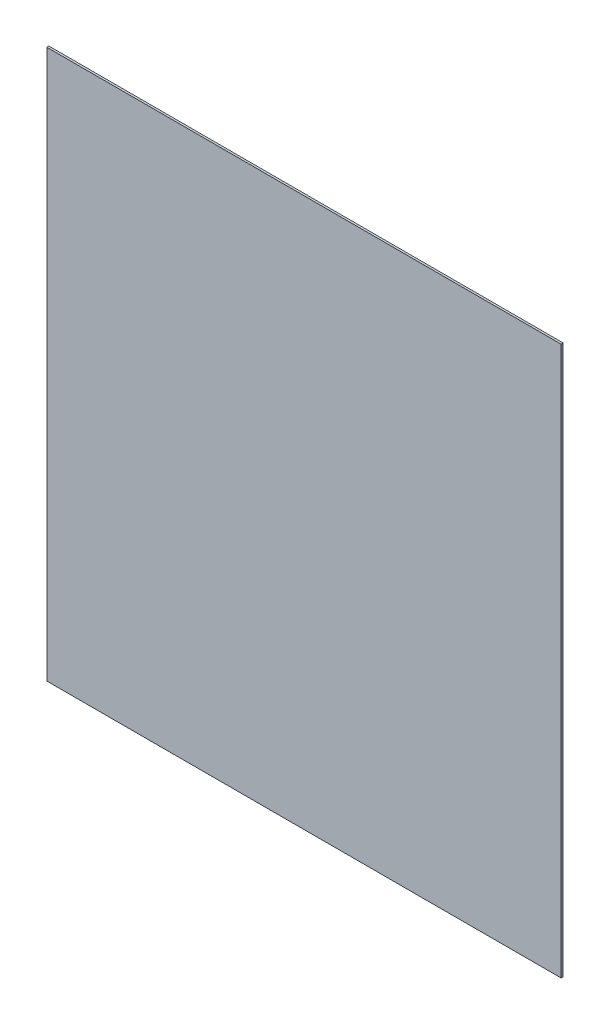
ISO-10303-21;
HEADER;
FILE_DESCRIPTION(('STEP AP214'),'2;1');
FILE_NAME('part.step','',(''),(''),'','','');
FILE_SCHEMA(('AUTOMOTIVE_DESIGN { 1 0 10303 214 1 1 1 1 }'));
ENDSEC;
DATA;
#1=APPLICATION_CONTEXT('core data for automotive mechanical design processes');
#2=APPLICATION_PROTOCOL_DEFINITION('international standard','automotive_design',2000,#1);
#3=PRODUCT_CONTEXT('',#1,'mechanical');
#4=PRODUCT('Part','Part','',(#3));
#5=PRODUCT_RELATED_PRODUCT_CATEGORY('part','',(#4));
#6=PRODUCT_DEFINITION_FORMATION('','',#4);
#7=PRODUCT_DEFINITION_CONTEXT('part definition',#1,'design');
#8=PRODUCT_DEFINITION('design','',#6,#7);
#9=PRODUCT_DEFINITION_SHAPE('','',#8);
#10=(LENGTH_UNIT() NAMED_UNIT(*) SI_UNIT(.MILLI.,.METRE.));
#11=(NAMED_UNIT(*) PLANE_ANGLE_UNIT() SI_UNIT($,.RADIAN.));
#12=(NAMED_UNIT(*) SI_UNIT($,.STERADIAN.) SOLID_ANGLE_UNIT());
#13=UNCERTAINTY_MEASURE_WITH_UNIT(LENGTH_MEASURE(1.E-05),#10,'distance_accuracy_value','');
#14=(GEOMETRIC_REPRESENTATION_CONTEXT(3) GLOBAL_UNCERTAINTY_ASSIGNED_CONTEXT((#13)) GLOBAL_UNIT_ASSIGNED_CONTEXT((#10,
#11,#12)) REPRESENTATION_CONTEXT('',''));
#15=CARTESIAN_POINT('',(0.,0.,0.));
#16=DIRECTION('',(0.,0.,1.));
#17=DIRECTION('',(1.,0.,0.));
#18=AXIS2_PLACEMENT_3D('',#15,#16,#17);
#19=CARTESIAN_POINT('',(241.80799865722,158.75,0.41148));
#20=DIRECTION('',(0.,0.,1.));
#21=DIRECTION('',(1.,0.,0.));
#22=AXIS2_PLACEMENT_3D('',#19,#20,#21);
#23=PLANE('',#22);
#24=DIRECTION('',(1.,0.,0.));
#25=VECTOR('',#24,1.);
#26=CARTESIAN_POINT('',(241.80799865722,49.784000396729,0.41148));
#27=LINE('',#26,#25);
#28=CARTESIAN_POINT('',(241.80799865722,49.784000396729,0.41148));
#29=VERTEX_POINT('',#28);
#30=CARTESIAN_POINT('',(139.69999694824,49.784000396729,0.41148));
#31=VERTEX_POINT('',#30);
#32=EDGE_CURVE('E52',#29,#31,#27,.F.);
#33=ORIENTED_EDGE('',*,*,#32,.F.);
#34=DIRECTION('',(0.,1.,0.));
#35=VECTOR('',#34,1.);
#36=CARTESIAN_POINT('',(241.80799865722,158.75,0.41148));
#37=LINE('',#36,#35);
#38=CARTESIAN_POINT('',(241.80799865722,158.75,0.41148));
#39=VERTEX_POINT('',#38);
#40=EDGE_CURVE('E67',#39,#29,#37,.F.);
#41=ORIENTED_EDGE('',*,*,#40,.F.);
#42=DIRECTION('',(1.,0.,0.));
#43=VECTOR('',#42,1.);
#44=CARTESIAN_POINT('',(139.69999694824,158.75,0.41148));
#45=LINE('',#44,#43);
#46=CARTESIAN_POINT('',(139.69999694824,158.75,0.41148));
#47=VERTEX_POINT('',#46);
#48=EDGE_CURVE('E19',#47,#39,#45,.T.);
#49=ORIENTED_EDGE('',*,*,#48,.F.);
#50=DIRECTION('',(0.,1.,0.));
#51=VECTOR('',#50,1.);
#52=CARTESIAN_POINT('',(139.69999694824,49.784000396729,0.41148));
#53=LINE('',#52,#51);
#54=EDGE_CURVE('E57',#31,#47,#53,.T.);
#55=ORIENTED_EDGE('',*,*,#54,.F.);
#56=EDGE_LOOP('',(#33,#41,#49,#55));
#57=FACE_BOUND('',#56,.T.);
#58=ADVANCED_FACE('F16',(#57),#23,.T.);
#59=CARTESIAN_POINT('',(139.69999694824,158.75,0.));
#60=DIRECTION('',(0.,1.,0.));
#61=DIRECTION('',(0.,0.,1.));
#62=AXIS2_PLACEMENT_3D('',#59,#60,#61);
#63=PLANE('',#62);
#64=DIRECTION('',(0.,0.,-1.));
#65=VECTOR('',#64,1.);
#66=CARTESIAN_POINT('',(241.80799865722,158.75,0.));
#67=LINE('',#66,#65);
#68=CARTESIAN_POINT('',(241.80799865722,158.75,0.));
#69=VERTEX_POINT('',#68);
#70=EDGE_CURVE('E78',#69,#39,#67,.F.);
#71=ORIENTED_EDGE('',*,*,#70,.F.);
#72=DIRECTION('',(1.,0.,0.));
#73=VECTOR('',#72,1.);
#74=CARTESIAN_POINT('',(241.80799865722,158.75,0.));
#75=LINE('',#74,#73);
#76=CARTESIAN_POINT('',(139.69999694824,158.75,0.));
#77=VERTEX_POINT('',#76);
#78=EDGE_CURVE('E73',#69,#77,#75,.F.);
#79=ORIENTED_EDGE('',*,*,#78,.T.);
#80=DIRECTION('',(0.,0.,1.));
#81=VECTOR('',#80,1.);
#82=CARTESIAN_POINT('',(139.69999694824,158.75,0.));
#83=LINE('',#82,#81);
#84=EDGE_CURVE('E62',#47,#77,#83,.F.);
#85=ORIENTED_EDGE('',*,*,#84,.F.);
#86=ORIENTED_EDGE('',*,*,#48,.T.);
#87=EDGE_LOOP('',(#71,#79,#85,#86));
#88=FACE_BOUND('',#87,.T.);
#89=ADVANCED_FACE('F72',(#88),#63,.T.);
#90=CARTESIAN_POINT('',(139.69999694824,49.784000396729,0.));
#91=DIRECTION('',(-1.,0.,0.));
#92=DIRECTION('',(0.,0.,1.));
#93=AXIS2_PLACEMENT_3D('',#90,#91,#92);
#94=PLANE('',#93);
#95=ORIENTED_EDGE('',*,*,#84,.T.);
#96=DIRECTION('',(0.,1.,0.));
#97=VECTOR('',#96,1.);
#98=CARTESIAN_POINT('',(139.69999694824,158.75,0.));
#99=LINE('',#98,#97);
#100=CARTESIAN_POINT('',(139.69999694824,49.784000396729,0.));
#101=VERTEX_POINT('',#100);
#102=EDGE_CURVE('E83',#77,#101,#99,.F.);
#103=ORIENTED_EDGE('',*,*,#102,.T.);
#104=DIRECTION('',(0.,0.,-1.));
#105=VECTOR('',#104,1.);
#106=CARTESIAN_POINT('',(139.69999694824,49.784000396729,0.));
#107=LINE('',#106,#105);
#108=EDGE_CURVE('E64',#31,#101,#107,.T.);
#109=ORIENTED_EDGE('',*,*,#108,.F.);
#110=ORIENTED_EDGE('',*,*,#54,.T.);
#111=EDGE_LOOP('',(#95,#103,#109,#110));
#112=FACE_BOUND('',#111,.T.);
#113=ADVANCED_FACE('F59',(#112),#94,.T.);
#114=CARTESIAN_POINT('',(241.80799865722,49.784000396729,0.));
#115=DIRECTION('',(0.,-1.,0.));
#116=DIRECTION('',(0.,0.,-1.));
#117=AXIS2_PLACEMENT_3D('',#114,#115,#116);
#118=PLANE('',#117);
#119=ORIENTED_EDGE('',*,*,#108,.T.);
#120=DIRECTION('',(1.,0.,0.));
#121=VECTOR('',#120,1.);
#122=CARTESIAN_POINT('',(241.80799865722,49.784000396729,0.));
#123=LINE('',#122,#121);
#124=CARTESIAN_POINT('',(241.80799865722,49.784000396729,0.));
#125=VERTEX_POINT('',#124);
#126=EDGE_CURVE('E25',#101,#125,#123,.T.);
#127=ORIENTED_EDGE('',*,*,#126,.T.);
#128=DIRECTION('',(0.,0.,-1.));
#129=VECTOR('',#128,1.);
#130=CARTESIAN_POINT('',(241.80799865722,49.784000396729,0.));
#131=LINE('',#130,#129);
#132=EDGE_CURVE('E33',#29,#125,#131,.T.);
#133=ORIENTED_EDGE('',*,*,#132,.F.);
#134=ORIENTED_EDGE('',*,*,#32,.T.);
#135=EDGE_LOOP('',(#119,#127,#133,#134));
#136=FACE_BOUND('',#135,.T.);
#137=ADVANCED_FACE('F87',(#136),#118,.T.);
#138=CARTESIAN_POINT('',(241.80799865722,158.75,0.));
#139=DIRECTION('',(1.,0.,0.));
#140=DIRECTION('',(0.,0.,-1.));
#141=AXIS2_PLACEMENT_3D('',#138,#139,#140);
#142=PLANE('',#141);
#143=ORIENTED_EDGE('',*,*,#132,.T.);
#144=DIRECTION('',(0.,1.,0.));
#145=VECTOR('',#144,1.);
#146=CARTESIAN_POINT('',(241.80799865722,158.75,0.));
#147=LINE('',#146,#145);
#148=EDGE_CURVE('E11',#125,#69,#147,.T.);
#149=ORIENTED_EDGE('',*,*,#148,.T.);
#150=ORIENTED_EDGE('',*,*,#70,.T.);
#151=ORIENTED_EDGE('',*,*,#40,.T.);
#152=EDGE_LOOP('',(#143,#149,#150,#151));
#153=FACE_BOUND('',#152,.T.);
#154=ADVANCED_FACE('F90',(#153),#142,.T.);
#155=CARTESIAN_POINT('',(241.80799865722,158.75,0.));
#156=DIRECTION('',(0.,0.,1.));
#157=DIRECTION('',(1.,0.,0.));
#158=AXIS2_PLACEMENT_3D('',#155,#156,#157);
#159=PLANE('',#158);
#160=ORIENTED_EDGE('',*,*,#126,.F.);
#161=ORIENTED_EDGE('',*,*,#102,.F.);
#162=ORIENTED_EDGE('',*,*,#78,.F.);
#163=ORIENTED_EDGE('',*,*,#148,.F.);
#164=EDGE_LOOP('',(#160,#161,#162,#163));
#165=FACE_BOUND('',#164,.T.);
#166=ADVANCED_FACE('F89',(#165),#159,.F.);
#167=CLOSED_SHELL('',(#58,#89,#113,#137,#154,#166));
#168=MANIFOLD_SOLID_BREP('B1',#167);
#169=ADVANCED_BREP_SHAPE_REPRESENTATION('',(#18,#168),#14);
#170=SHAPE_DEFINITION_REPRESENTATION(#9,#169);
ENDSEC;
END-ISO-10303-21;
